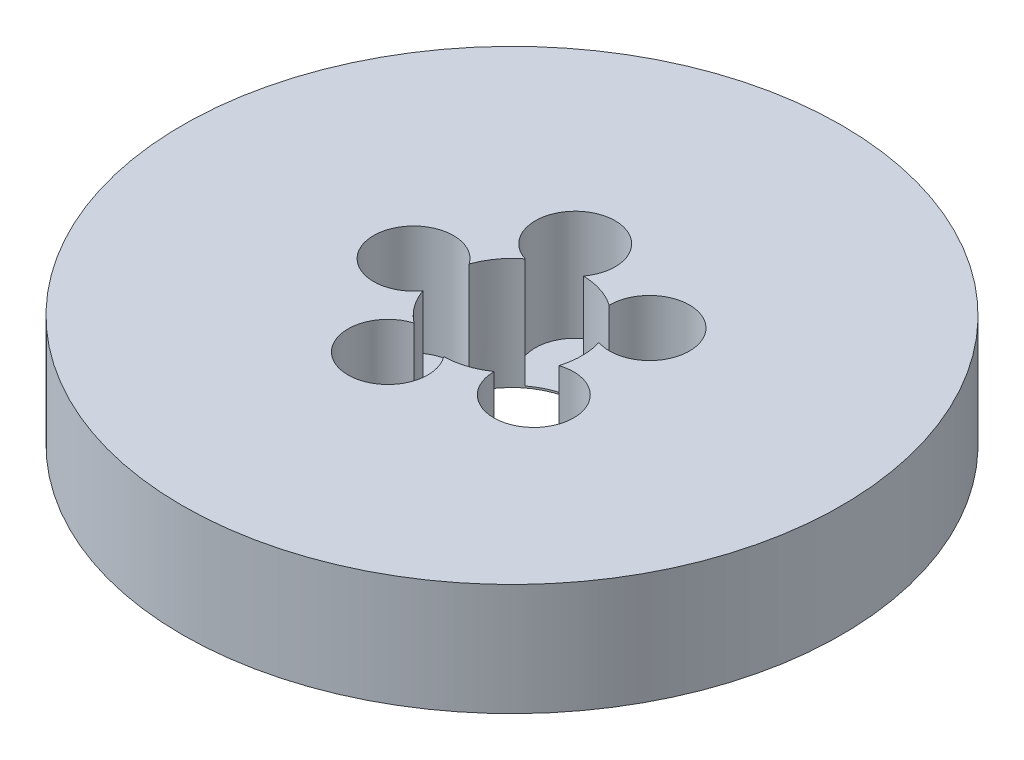
ISO-10303-21;
HEADER;
FILE_DESCRIPTION(('STEP AP214'),'2;1');
FILE_NAME('part.step','',(''),(''),'','','');
FILE_SCHEMA(('AUTOMOTIVE_DESIGN { 1 0 10303 214 1 1 1 1 }'));
ENDSEC;
DATA;
#1=APPLICATION_CONTEXT('core data for automotive mechanical design processes');
#2=APPLICATION_PROTOCOL_DEFINITION('international standard','automotive_design',2000,#1);
#3=PRODUCT_CONTEXT('',#1,'mechanical');
#4=PRODUCT('Part','Part','',(#3));
#5=PRODUCT_RELATED_PRODUCT_CATEGORY('part','',(#4));
#6=PRODUCT_DEFINITION_FORMATION('','',#4);
#7=PRODUCT_DEFINITION_CONTEXT('part definition',#1,'design');
#8=PRODUCT_DEFINITION('design','',#6,#7);
#9=PRODUCT_DEFINITION_SHAPE('','',#8);
#10=(LENGTH_UNIT() NAMED_UNIT(*) SI_UNIT(.MILLI.,.METRE.));
#11=(NAMED_UNIT(*) PLANE_ANGLE_UNIT() SI_UNIT($,.RADIAN.));
#12=(NAMED_UNIT(*) SI_UNIT($,.STERADIAN.) SOLID_ANGLE_UNIT());
#13=UNCERTAINTY_MEASURE_WITH_UNIT(LENGTH_MEASURE(1.E-05),#10,'distance_accuracy_value','');
#14=(GEOMETRIC_REPRESENTATION_CONTEXT(3) GLOBAL_UNCERTAINTY_ASSIGNED_CONTEXT((#13)) GLOBAL_UNIT_ASSIGNED_CONTEXT((#10,
#11,#12)) REPRESENTATION_CONTEXT('',''));
#15=CARTESIAN_POINT('',(0.,0.,0.));
#16=DIRECTION('',(0.,0.,1.));
#17=DIRECTION('',(1.,0.,0.));
#18=AXIS2_PLACEMENT_3D('',#15,#16,#17);
#19=CARTESIAN_POINT('',(0.,28.,0.));
#20=DIRECTION('',(0.,-1.,0.));
#21=DIRECTION('',(0.,0.,-1.));
#22=AXIS2_PLACEMENT_3D('',#19,#20,#21);
#23=CYLINDRICAL_SURFACE('',#22,82.5);
#24=CARTESIAN_POINT('',(0.,28.,0.));
#25=DIRECTION('',(0.,1.,0.));
#26=DIRECTION('',(0.,0.,1.));
#27=AXIS2_PLACEMENT_3D('',#24,#25,#26);
#28=CIRCLE('',#27,82.5);
#29=CARTESIAN_POINT('',(0.,28.,82.5));
#30=VERTEX_POINT('',#29);
#31=EDGE_CURVE('E157',#30,#30,#28,.T.);
#32=ORIENTED_EDGE('',*,*,#31,.F.);
#33=EDGE_LOOP('',(#32));
#34=FACE_BOUND('',#33,.T.);
#35=CARTESIAN_POINT('',(0.,0.,0.));
#36=DIRECTION('',(0.,1.,0.));
#37=DIRECTION('',(0.,0.,1.));
#38=AXIS2_PLACEMENT_3D('',#35,#36,#37);
#39=CIRCLE('',#38,82.5);
#40=CARTESIAN_POINT('',(0.,0.,82.5));
#41=VERTEX_POINT('',#40);
#42=EDGE_CURVE('E150',#41,#41,#39,.T.);
#43=ORIENTED_EDGE('',*,*,#42,.T.);
#44=EDGE_LOOP('',(#43));
#45=FACE_BOUND('',#44,.T.);
#46=ADVANCED_FACE('F39',(#34,#45),#23,.T.);
#47=CARTESIAN_POINT('',(0.,28.,0.));
#48=DIRECTION('',(0.,1.,0.));
#49=DIRECTION('',(0.,0.,1.));
#50=AXIS2_PLACEMENT_3D('',#47,#48,#49);
#51=PLANE('',#50);
#52=CARTESIAN_POINT('',(-7.61766926992819,28.,-23.4447753037029));
#53=DIRECTION('',(0.,1.,0.));
#54=DIRECTION('',(-0.95105651629515,0.,0.309016994374958));
#55=AXIS2_PLACEMENT_3D('',#52,#53,#54);
#56=CIRCLE('',#55,10.);
#57=CARTESIAN_POINT('',(0.419728734484265,28.,-17.4949657841748));
#58=VERTEX_POINT('',#57);
#59=CARTESIAN_POINT('',(-10.622850556525,28.,-13.9070142753122));
#60=VERTEX_POINT('',#59);
#61=EDGE_CURVE('E194',#58,#60,#56,.T.);
#62=ORIENTED_EDGE('',*,*,#61,.F.);
#63=CARTESIAN_POINT('',(0.,28.,0.));
#64=DIRECTION('',(0.,1.,0.));
#65=DIRECTION('',(0.,0.,1.));
#66=AXIS2_PLACEMENT_3D('',#63,#64,#65);
#67=CIRCLE('',#66,17.5);
#68=CARTESIAN_POINT('',(9.94371519807384,28.,-14.4004349954991));
#69=VERTEX_POINT('',#68);
#70=EDGE_CURVE('E147',#69,#58,#67,.T.);
#71=ORIENTED_EDGE('',*,*,#70,.F.);
#72=CARTESIAN_POINT('',(19.9433170637268,28.,-14.4896679962928));
#73=DIRECTION('',(0.,1.,0.));
#74=DIRECTION('',(-0.58778525229248,0.,-0.809016994374942));
#75=AXIS2_PLACEMENT_3D('',#72,#73,#74);
#76=CIRCLE('',#75,10.);
#77=CARTESIAN_POINT('',(16.7684045233834,28.,-5.00705599531063));
#78=VERTEX_POINT('',#77);
#79=EDGE_CURVE('E254',#78,#69,#76,.T.);
#80=ORIENTED_EDGE('',*,*,#79,.F.);
#81=CARTESIAN_POINT('',(16.7684045233834,28.,5.00705599531039));
#82=VERTEX_POINT('',#81);
#83=EDGE_CURVE('E144',#82,#78,#67,.T.);
#84=ORIENTED_EDGE('',*,*,#83,.F.);
#85=CARTESIAN_POINT('',(19.943317063727,28.,14.4896679962925));
#86=DIRECTION('',(0.,1.,0.));
#87=DIRECTION('',(0.587785252292469,0.,-0.809016994374951));
#88=AXIS2_PLACEMENT_3D('',#85,#86,#87);
#89=CIRCLE('',#88,10.);
#90=CARTESIAN_POINT('',(9.94371519807405,28.,14.400434995499));
#91=VERTEX_POINT('',#90);
#92=EDGE_CURVE('E141',#91,#82,#89,.T.);
#93=ORIENTED_EDGE('',*,*,#92,.F.);
#94=CARTESIAN_POINT('',(0.419728734484511,28.,17.4949657841748));
#95=VERTEX_POINT('',#94);
#96=EDGE_CURVE('E134',#95,#91,#67,.T.);
#97=ORIENTED_EDGE('',*,*,#96,.F.);
#98=CARTESIAN_POINT('',(-7.61766926992785,28.,23.444775303703));
#99=DIRECTION('',(0.,1.,0.));
#100=DIRECTION('',(0.951056516295155,0.,0.309016994374945));
#101=AXIS2_PLACEMENT_3D('',#98,#99,#100);
#102=CIRCLE('',#101,10.);
#103=CARTESIAN_POINT('',(-10.6228505565248,28.,13.9070142753124));
#104=VERTEX_POINT('',#103);
#105=EDGE_CURVE('E111',#104,#95,#102,.T.);
#106=ORIENTED_EDGE('',*,*,#105,.F.);
#107=CARTESIAN_POINT('',(-16.508997899417,28.,5.80542749132602));
#108=VERTEX_POINT('',#107);
#109=EDGE_CURVE('E145',#108,#104,#67,.T.);
#110=ORIENTED_EDGE('',*,*,#109,.F.);
#111=CARTESIAN_POINT('',(-24.6512955875979,28.,0.));
#112=DIRECTION('',(0.,1.,0.));
#113=DIRECTION('',(0.,0.,1.));
#114=AXIS2_PLACEMENT_3D('',#111,#112,#113);
#115=CIRCLE('',#114,10.);
#116=CARTESIAN_POINT('',(-16.508997899417,28.,-5.80542749132602));
#117=VERTEX_POINT('',#116);
#118=EDGE_CURVE('E153',#117,#108,#115,.T.);
#119=ORIENTED_EDGE('',*,*,#118,.F.);
#120=EDGE_CURVE('E146',#60,#117,#67,.T.);
#121=ORIENTED_EDGE('',*,*,#120,.F.);
#122=EDGE_LOOP('',(#62,#71,#80,#84,#93,#97,#106,#110,#119,#121));
#123=FACE_BOUND('',#122,.T.);
#124=ORIENTED_EDGE('',*,*,#31,.T.);
#125=EDGE_LOOP('',(#124));
#126=FACE_BOUND('',#125,.T.);
#127=ADVANCED_FACE('F139',(#123,#126),#51,.T.);
#128=CARTESIAN_POINT('',(0.,0.,0.));
#129=DIRECTION('',(0.,1.,0.));
#130=DIRECTION('',(0.,0.,1.));
#131=AXIS2_PLACEMENT_3D('',#128,#129,#130);
#132=PLANE('',#131);
#133=CARTESIAN_POINT('',(0.,0.,0.));
#134=DIRECTION('',(0.,1.,0.));
#135=DIRECTION('',(0.,0.,1.));
#136=AXIS2_PLACEMENT_3D('',#133,#134,#135);
#137=CIRCLE('',#136,17.5);
#138=CARTESIAN_POINT('',(0.,0.,17.5));
#139=VERTEX_POINT('',#138);
#140=EDGE_CURVE('E154',#139,#139,#137,.T.);
#141=ORIENTED_EDGE('',*,*,#140,.T.);
#142=EDGE_LOOP('',(#141));
#143=FACE_BOUND('',#142,.T.);
#144=ORIENTED_EDGE('',*,*,#42,.F.);
#145=EDGE_LOOP('',(#144));
#146=FACE_BOUND('',#145,.T.);
#147=ADVANCED_FACE('F213',(#143,#146),#132,.F.);
#148=CARTESIAN_POINT('',(0.,28.,0.));
#149=DIRECTION('',(0.,-1.,0.));
#150=DIRECTION('',(0.,0.,-1.));
#151=AXIS2_PLACEMENT_3D('',#148,#149,#150);
#152=CYLINDRICAL_SURFACE('',#151,17.5);
#153=DIRECTION('',(0.,1.,0.));
#154=VECTOR('',#153,1.);
#155=CARTESIAN_POINT('',(0.419728734484266,14.2261317722697,-17.4949657841748));
#156=LINE('',#155,#154);
#157=CARTESIAN_POINT('',(0.419728734484265,0.452263544539401,-17.4949657841748));
#158=VERTEX_POINT('',#157);
#159=EDGE_CURVE('E11',#158,#58,#156,.T.);
#160=ORIENTED_EDGE('',*,*,#159,.F.);
#161=CARTESIAN_POINT('',(0.,0.452263544539401,0.));
#162=DIRECTION('',(0.,1.,0.));
#163=DIRECTION('',(0.,0.,1.));
#164=AXIS2_PLACEMENT_3D('',#161,#162,#163);
#165=CIRCLE('',#164,17.5);
#166=CARTESIAN_POINT('',(-10.622850556525,0.452263544539401,-13.9070142753122));
#167=VERTEX_POINT('',#166);
#168=EDGE_CURVE('E189',#158,#167,#165,.T.);
#169=ORIENTED_EDGE('',*,*,#168,.T.);
#170=DIRECTION('',(0.,1.,0.));
#171=VECTOR('',#170,1.);
#172=CARTESIAN_POINT('',(-10.622850556525,14.2261317722697,-13.9070142753122));
#173=LINE('',#172,#171);
#174=EDGE_CURVE('E46',#60,#167,#173,.F.);
#175=ORIENTED_EDGE('',*,*,#174,.F.);
#176=ORIENTED_EDGE('',*,*,#120,.T.);
#177=DIRECTION('',(0.,1.,0.));
#178=VECTOR('',#177,1.);
#179=CARTESIAN_POINT('',(-16.508997899417,14.2261317722697,-5.80542749132602));
#180=LINE('',#179,#178);
#181=CARTESIAN_POINT('',(-16.508997899417,0.452263544539401,-5.80542749132602));
#182=VERTEX_POINT('',#181);
#183=EDGE_CURVE('E168',#182,#117,#180,.T.);
#184=ORIENTED_EDGE('',*,*,#183,.F.);
#185=CARTESIAN_POINT('',(0.,0.452263544539401,0.));
#186=DIRECTION('',(0.,1.,0.));
#187=DIRECTION('',(0.,0.,1.));
#188=AXIS2_PLACEMENT_3D('',#185,#186,#187);
#189=CIRCLE('',#188,17.5);
#190=CARTESIAN_POINT('',(-16.508997899417,0.452263544539401,5.80542749132602));
#191=VERTEX_POINT('',#190);
#192=EDGE_CURVE('E165',#182,#191,#189,.T.);
#193=ORIENTED_EDGE('',*,*,#192,.T.);
#194=DIRECTION('',(0.,1.,0.));
#195=VECTOR('',#194,1.);
#196=CARTESIAN_POINT('',(-16.508997899417,14.2261317722697,5.80542749132602));
#197=LINE('',#196,#195);
#198=EDGE_CURVE('E170',#108,#191,#197,.F.);
#199=ORIENTED_EDGE('',*,*,#198,.F.);
#200=ORIENTED_EDGE('',*,*,#109,.T.);
#201=DIRECTION('',(0.,1.,0.));
#202=VECTOR('',#201,1.);
#203=CARTESIAN_POINT('',(-10.6228505565248,14.2261317722697,13.9070142753124));
#204=LINE('',#203,#202);
#205=CARTESIAN_POINT('',(-10.6228505565248,0.452263544539401,13.9070142753124));
#206=VERTEX_POINT('',#205);
#207=EDGE_CURVE('E121',#206,#104,#204,.T.);
#208=ORIENTED_EDGE('',*,*,#207,.F.);
#209=CARTESIAN_POINT('',(0.,0.452263544539401,0.));
#210=DIRECTION('',(0.,1.,0.));
#211=DIRECTION('',(0.,0.,1.));
#212=AXIS2_PLACEMENT_3D('',#209,#210,#211);
#213=CIRCLE('',#212,17.5);
#214=CARTESIAN_POINT('',(0.419728734484511,0.452263544539401,17.4949657841748));
#215=VERTEX_POINT('',#214);
#216=EDGE_CURVE('E136',#206,#215,#213,.T.);
#217=ORIENTED_EDGE('',*,*,#216,.T.);
#218=DIRECTION('',(0.,1.,0.));
#219=VECTOR('',#218,1.);
#220=CARTESIAN_POINT('',(0.419728734484507,14.2261317722697,17.4949657841748));
#221=LINE('',#220,#219);
#222=EDGE_CURVE('E117',#95,#215,#221,.F.);
#223=ORIENTED_EDGE('',*,*,#222,.F.);
#224=ORIENTED_EDGE('',*,*,#96,.T.);
#225=DIRECTION('',(0.,1.,0.));
#226=VECTOR('',#225,1.);
#227=CARTESIAN_POINT('',(9.94371519807405,14.2261317722697,14.400434995499));
#228=LINE('',#227,#226);
#229=CARTESIAN_POINT('',(9.94371519807405,0.452263544539401,14.400434995499));
#230=VERTEX_POINT('',#229);
#231=EDGE_CURVE('E182',#230,#91,#228,.T.);
#232=ORIENTED_EDGE('',*,*,#231,.F.);
#233=CARTESIAN_POINT('',(0.,0.452263544539401,0.));
#234=DIRECTION('',(0.,1.,0.));
#235=DIRECTION('',(0.,0.,1.));
#236=AXIS2_PLACEMENT_3D('',#233,#234,#235);
#237=CIRCLE('',#236,17.5);
#238=CARTESIAN_POINT('',(16.7684045233834,0.452263544539401,5.00705599531039));
#239=VERTEX_POINT('',#238);
#240=EDGE_CURVE('E174',#230,#239,#237,.T.);
#241=ORIENTED_EDGE('',*,*,#240,.T.);
#242=DIRECTION('',(0.,1.,0.));
#243=VECTOR('',#242,1.);
#244=CARTESIAN_POINT('',(16.7684045233834,14.2261317722697,5.00705599531039));
#245=LINE('',#244,#243);
#246=EDGE_CURVE('E177',#82,#239,#245,.F.);
#247=ORIENTED_EDGE('',*,*,#246,.F.);
#248=ORIENTED_EDGE('',*,*,#83,.T.);
#249=DIRECTION('',(0.,1.,0.));
#250=VECTOR('',#249,1.);
#251=CARTESIAN_POINT('',(16.7684045233834,14.2261317722697,-5.00705599531063));
#252=LINE('',#251,#250);
#253=CARTESIAN_POINT('',(16.7684045233834,0.452263544539401,-5.00705599531063));
#254=VERTEX_POINT('',#253);
#255=EDGE_CURVE('E187',#254,#78,#252,.T.);
#256=ORIENTED_EDGE('',*,*,#255,.F.);
#257=CARTESIAN_POINT('',(0.,0.452263544539401,0.));
#258=DIRECTION('',(0.,1.,0.));
#259=DIRECTION('',(0.,0.,1.));
#260=AXIS2_PLACEMENT_3D('',#257,#258,#259);
#261=CIRCLE('',#260,17.5);
#262=CARTESIAN_POINT('',(9.94371519807384,0.452263544539401,-14.4004349954991));
#263=VERTEX_POINT('',#262);
#264=EDGE_CURVE('E181',#254,#263,#261,.T.);
#265=ORIENTED_EDGE('',*,*,#264,.T.);
#266=DIRECTION('',(0.,1.,0.));
#267=VECTOR('',#266,1.);
#268=CARTESIAN_POINT('',(9.94371519807384,14.2261317722697,-14.4004349954991));
#269=LINE('',#268,#267);
#270=EDGE_CURVE('E186',#69,#263,#269,.F.);
#271=ORIENTED_EDGE('',*,*,#270,.F.);
#272=ORIENTED_EDGE('',*,*,#70,.T.);
#273=EDGE_LOOP('',(#160,#169,#175,#176,#184,#193,#199,#200,#208,#217,#223,#224,#232,#241,#247,
#248,#256,#265,#271,#272));
#274=FACE_BOUND('',#273,.T.);
#275=ORIENTED_EDGE('',*,*,#140,.F.);
#276=EDGE_LOOP('',(#275));
#277=FACE_BOUND('',#276,.T.);
#278=ADVANCED_FACE('F135',(#274,#277),#152,.F.);
#279=CARTESIAN_POINT('',(-24.6512955875979,0.452263544539401,0.));
#280=DIRECTION('',(0.,1.,0.));
#281=DIRECTION('',(0.,0.,1.));
#282=AXIS2_PLACEMENT_3D('',#279,#280,#281);
#283=CYLINDRICAL_SURFACE('',#282,10.);
#284=ORIENTED_EDGE('',*,*,#183,.T.);
#285=ORIENTED_EDGE('',*,*,#118,.T.);
#286=ORIENTED_EDGE('',*,*,#198,.T.);
#287=CARTESIAN_POINT('',(-24.6512955875979,0.452263544539401,0.));
#288=DIRECTION('',(0.,1.,0.));
#289=DIRECTION('',(0.,0.,1.));
#290=AXIS2_PLACEMENT_3D('',#287,#288,#289);
#291=CIRCLE('',#290,10.);
#292=EDGE_CURVE('E158',#182,#191,#291,.T.);
#293=ORIENTED_EDGE('',*,*,#292,.F.);
#294=EDGE_LOOP('',(#284,#285,#286,#293));
#295=FACE_BOUND('',#294,.T.);
#296=ADVANCED_FACE('F221',(#295),#283,.F.);
#297=CARTESIAN_POINT('',(-24.6512955875979,0.452263544539401,0.));
#298=DIRECTION('',(0.,1.,0.));
#299=DIRECTION('',(0.,0.,1.));
#300=AXIS2_PLACEMENT_3D('',#297,#298,#299);
#301=PLANE('',#300);
#302=ORIENTED_EDGE('',*,*,#292,.T.);
#303=ORIENTED_EDGE('',*,*,#192,.F.);
#304=EDGE_LOOP('',(#302,#303));
#305=FACE_BOUND('',#304,.T.);
#306=ADVANCED_FACE('F227',(#305),#301,.T.);
#307=CARTESIAN_POINT('',(-7.61766926992785,0.452263544539401,23.444775303703));
#308=DIRECTION('',(0.,1.,0.));
#309=DIRECTION('',(0.,0.,1.));
#310=AXIS2_PLACEMENT_3D('',#307,#308,#309);
#311=CYLINDRICAL_SURFACE('',#310,10.);
#312=ORIENTED_EDGE('',*,*,#207,.T.);
#313=ORIENTED_EDGE('',*,*,#105,.T.);
#314=ORIENTED_EDGE('',*,*,#222,.T.);
#315=CARTESIAN_POINT('',(-7.61766926992785,0.452263544539401,23.444775303703));
#316=DIRECTION('',(0.,1.,0.));
#317=DIRECTION('',(0.951056516295155,0.,0.309016994374945));
#318=AXIS2_PLACEMENT_3D('',#315,#316,#317);
#319=CIRCLE('',#318,10.);
#320=EDGE_CURVE('E127',#206,#215,#319,.T.);
#321=ORIENTED_EDGE('',*,*,#320,.F.);
#322=EDGE_LOOP('',(#312,#313,#314,#321));
#323=FACE_BOUND('',#322,.T.);
#324=ADVANCED_FACE('F116',(#323),#311,.F.);
#325=CARTESIAN_POINT('',(-7.61766926992785,0.452263544539401,23.444775303703));
#326=DIRECTION('',(0.,1.,0.));
#327=DIRECTION('',(0.951056516295155,0.,0.309016994374945));
#328=AXIS2_PLACEMENT_3D('',#325,#326,#327);
#329=PLANE('',#328);
#330=ORIENTED_EDGE('',*,*,#320,.T.);
#331=ORIENTED_EDGE('',*,*,#216,.F.);
#332=EDGE_LOOP('',(#330,#331));
#333=FACE_BOUND('',#332,.T.);
#334=ADVANCED_FACE('F234',(#333),#329,.T.);
#335=CARTESIAN_POINT('',(19.943317063727,0.452263544539401,14.4896679962925));
#336=DIRECTION('',(0.,1.,0.));
#337=DIRECTION('',(0.,0.,1.));
#338=AXIS2_PLACEMENT_3D('',#335,#336,#337);
#339=CYLINDRICAL_SURFACE('',#338,10.);
#340=ORIENTED_EDGE('',*,*,#231,.T.);
#341=ORIENTED_EDGE('',*,*,#92,.T.);
#342=ORIENTED_EDGE('',*,*,#246,.T.);
#343=CARTESIAN_POINT('',(19.943317063727,0.452263544539401,14.4896679962925));
#344=DIRECTION('',(0.,1.,0.));
#345=DIRECTION('',(0.587785252292469,0.,-0.809016994374951));
#346=AXIS2_PLACEMENT_3D('',#343,#344,#345);
#347=CIRCLE('',#346,10.);
#348=EDGE_CURVE('E130',#230,#239,#347,.T.);
#349=ORIENTED_EDGE('',*,*,#348,.F.);
#350=EDGE_LOOP('',(#340,#341,#342,#349));
#351=FACE_BOUND('',#350,.T.);
#352=ADVANCED_FACE('F240',(#351),#339,.F.);
#353=CARTESIAN_POINT('',(19.943317063727,0.452263544539401,14.4896679962925));
#354=DIRECTION('',(0.,1.,0.));
#355=DIRECTION('',(0.587785252292469,0.,-0.809016994374951));
#356=AXIS2_PLACEMENT_3D('',#353,#354,#355);
#357=PLANE('',#356);
#358=ORIENTED_EDGE('',*,*,#348,.T.);
#359=ORIENTED_EDGE('',*,*,#240,.F.);
#360=EDGE_LOOP('',(#358,#359));
#361=FACE_BOUND('',#360,.T.);
#362=ADVANCED_FACE('F245',(#361),#357,.T.);
#363=CARTESIAN_POINT('',(19.9433170637268,0.452263544539401,-14.4896679962928));
#364=DIRECTION('',(0.,1.,0.));
#365=DIRECTION('',(0.,0.,1.));
#366=AXIS2_PLACEMENT_3D('',#363,#364,#365);
#367=CYLINDRICAL_SURFACE('',#366,10.);
#368=ORIENTED_EDGE('',*,*,#255,.T.);
#369=ORIENTED_EDGE('',*,*,#79,.T.);
#370=ORIENTED_EDGE('',*,*,#270,.T.);
#371=CARTESIAN_POINT('',(19.9433170637268,0.452263544539401,-14.4896679962928));
#372=DIRECTION('',(0.,1.,0.));
#373=DIRECTION('',(-0.58778525229248,0.,-0.809016994374942));
#374=AXIS2_PLACEMENT_3D('',#371,#372,#373);
#375=CIRCLE('',#374,10.);
#376=EDGE_CURVE('E56',#254,#263,#375,.T.);
#377=ORIENTED_EDGE('',*,*,#376,.F.);
#378=EDGE_LOOP('',(#368,#369,#370,#377));
#379=FACE_BOUND('',#378,.T.);
#380=ADVANCED_FACE('F266',(#379),#367,.F.);
#381=CARTESIAN_POINT('',(19.9433170637268,0.452263544539401,-14.4896679962928));
#382=DIRECTION('',(0.,1.,0.));
#383=DIRECTION('',(-0.58778525229248,0.,-0.809016994374942));
#384=AXIS2_PLACEMENT_3D('',#381,#382,#383);
#385=PLANE('',#384);
#386=ORIENTED_EDGE('',*,*,#376,.T.);
#387=ORIENTED_EDGE('',*,*,#264,.F.);
#388=EDGE_LOOP('',(#386,#387));
#389=FACE_BOUND('',#388,.T.);
#390=ADVANCED_FACE('F204',(#389),#385,.T.);
#391=CARTESIAN_POINT('',(-7.61766926992819,0.452263544539401,-23.4447753037029));
#392=DIRECTION('',(0.,1.,0.));
#393=DIRECTION('',(0.,0.,1.));
#394=AXIS2_PLACEMENT_3D('',#391,#392,#393);
#395=CYLINDRICAL_SURFACE('',#394,10.);
#396=ORIENTED_EDGE('',*,*,#159,.T.);
#397=ORIENTED_EDGE('',*,*,#61,.T.);
#398=ORIENTED_EDGE('',*,*,#174,.T.);
#399=CARTESIAN_POINT('',(-7.61766926992819,0.452263544539401,-23.4447753037029));
#400=DIRECTION('',(0.,1.,0.));
#401=DIRECTION('',(-0.95105651629515,0.,0.309016994374958));
#402=AXIS2_PLACEMENT_3D('',#399,#400,#401);
#403=CIRCLE('',#402,10.);
#404=EDGE_CURVE('E55',#158,#167,#403,.T.);
#405=ORIENTED_EDGE('',*,*,#404,.F.);
#406=EDGE_LOOP('',(#396,#397,#398,#405));
#407=FACE_BOUND('',#406,.T.);
#408=ADVANCED_FACE('F193',(#407),#395,.F.);
#409=CARTESIAN_POINT('',(-7.61766926992819,0.452263544539401,-23.4447753037029));
#410=DIRECTION('',(0.,1.,0.));
#411=DIRECTION('',(-0.95105651629515,0.,0.309016994374958));
#412=AXIS2_PLACEMENT_3D('',#409,#410,#411);
#413=PLANE('',#412);
#414=ORIENTED_EDGE('',*,*,#404,.T.);
#415=ORIENTED_EDGE('',*,*,#168,.F.);
#416=EDGE_LOOP('',(#414,#415));
#417=FACE_BOUND('',#416,.T.);
#418=ADVANCED_FACE('F196',(#417),#413,.T.);
#419=CLOSED_SHELL('',(#46,#127,#147,#278,#296,#306,#324,#334,#352,#362,#380,#390,#408,#418));
#420=MANIFOLD_SOLID_BREP('B2',#419);
#421=ADVANCED_BREP_SHAPE_REPRESENTATION('',(#18,#420),#14);
#422=SHAPE_DEFINITION_REPRESENTATION(#9,#421);
ENDSEC;
END-ISO-10303-21;
